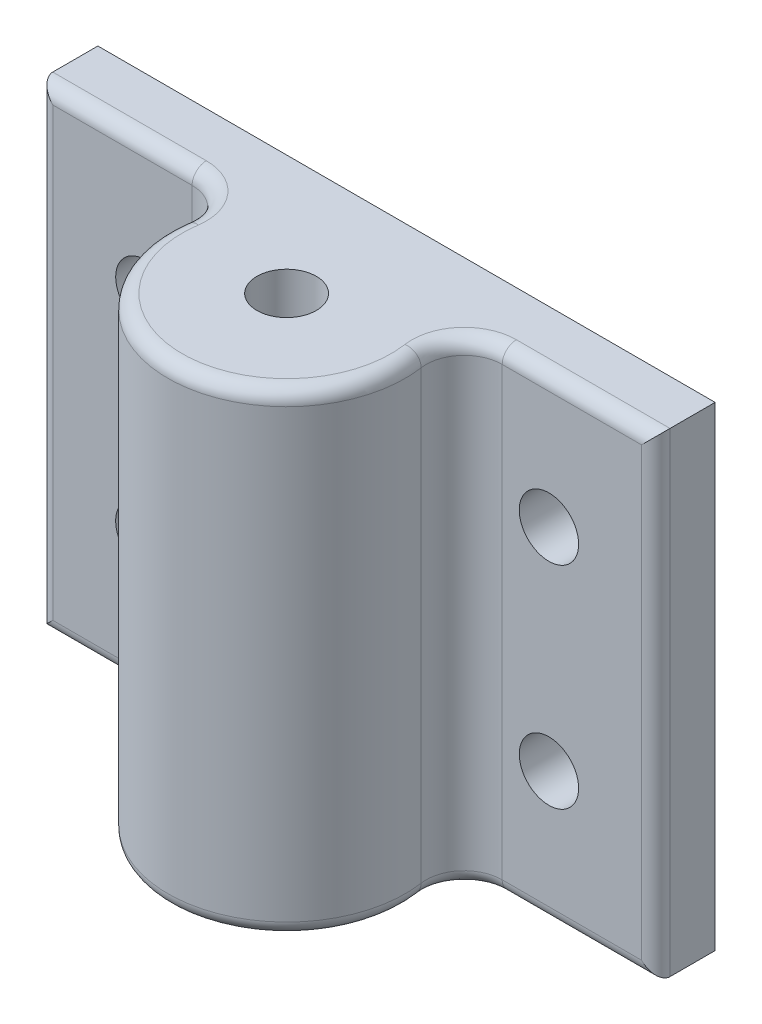
ISO-10303-21;
HEADER;
FILE_DESCRIPTION(('STEP AP214'),'2;1');
FILE_NAME('part.step','',(''),(''),'','','');
FILE_SCHEMA(('AUTOMOTIVE_DESIGN { 1 0 10303 214 1 1 1 1 }'));
ENDSEC;
DATA;
#1=APPLICATION_CONTEXT('core data for automotive mechanical design processes');
#2=APPLICATION_PROTOCOL_DEFINITION('international standard','automotive_design',2000,#1);
#3=PRODUCT_CONTEXT('',#1,'mechanical');
#4=PRODUCT('Part','Part','',(#3));
#5=PRODUCT_RELATED_PRODUCT_CATEGORY('part','',(#4));
#6=PRODUCT_DEFINITION_FORMATION('','',#4);
#7=PRODUCT_DEFINITION_CONTEXT('part definition',#1,'design');
#8=PRODUCT_DEFINITION('design','',#6,#7);
#9=PRODUCT_DEFINITION_SHAPE('','',#8);
#10=(LENGTH_UNIT() NAMED_UNIT(*) SI_UNIT(.MILLI.,.METRE.));
#11=(NAMED_UNIT(*) PLANE_ANGLE_UNIT() SI_UNIT($,.RADIAN.));
#12=(NAMED_UNIT(*) SI_UNIT($,.STERADIAN.) SOLID_ANGLE_UNIT());
#13=UNCERTAINTY_MEASURE_WITH_UNIT(LENGTH_MEASURE(1.E-05),#10,'distance_accuracy_value','');
#14=(GEOMETRIC_REPRESENTATION_CONTEXT(3) GLOBAL_UNCERTAINTY_ASSIGNED_CONTEXT((#13)) GLOBAL_UNIT_ASSIGNED_CONTEXT((#10,
#11,#12)) REPRESENTATION_CONTEXT('',''));
#15=CARTESIAN_POINT('',(0.,0.,0.));
#16=DIRECTION('',(0.,0.,1.));
#17=DIRECTION('',(1.,0.,0.));
#18=AXIS2_PLACEMENT_3D('',#15,#16,#17);
#19=CARTESIAN_POINT('',(0.,12.7,0.));
#20=DIRECTION('',(0.,-1.,0.));
#21=DIRECTION('',(0.,0.,-1.));
#22=AXIS2_PLACEMENT_3D('',#19,#20,#21);
#23=CYLINDRICAL_SURFACE('',#22,6.35);
#24=DIRECTION('',(0.,-1.,0.));
#25=VECTOR('',#24,1.);
#26=CARTESIAN_POINT('',(-6.28387430673153,12.7,-0.914015151515158));
#27=LINE('',#26,#25);
#28=CARTESIAN_POINT('',(-6.28387430673153,11.938,-0.914015151515158));
#29=VERTEX_POINT('',#28);
#30=CARTESIAN_POINT('',(-6.28387430673153,-11.938,-0.914015151515158));
#31=VERTEX_POINT('',#30);
#32=EDGE_CURVE('E163',#29,#31,#27,.T.);
#33=ORIENTED_EDGE('',*,*,#32,.T.);
#34=CARTESIAN_POINT('',(0.,-11.938,0.));
#35=DIRECTION('',(0.,1.,0.));
#36=DIRECTION('',(0.,0.,1.));
#37=AXIS2_PLACEMENT_3D('',#34,#35,#36);
#38=CIRCLE('',#37,6.35);
#39=CARTESIAN_POINT('',(6.28387430673153,-11.938,-0.914015151515158));
#40=VERTEX_POINT('',#39);
#41=EDGE_CURVE('E217',#31,#40,#38,.T.);
#42=ORIENTED_EDGE('',*,*,#41,.T.);
#43=DIRECTION('',(0.,-1.,0.));
#44=VECTOR('',#43,1.);
#45=CARTESIAN_POINT('',(6.28387430673153,12.7,-0.914015151515158));
#46=LINE('',#45,#44);
#47=CARTESIAN_POINT('',(6.28387430673153,11.938,-0.914015151515158));
#48=VERTEX_POINT('',#47);
#49=EDGE_CURVE('E160',#40,#48,#46,.F.);
#50=ORIENTED_EDGE('',*,*,#49,.T.);
#51=CARTESIAN_POINT('',(0.,11.938,0.));
#52=DIRECTION('',(0.,1.,0.));
#53=DIRECTION('',(0.,0.,1.));
#54=AXIS2_PLACEMENT_3D('',#51,#52,#53);
#55=CIRCLE('',#54,6.35);
#56=EDGE_CURVE('E215',#48,#29,#55,.F.);
#57=ORIENTED_EDGE('',*,*,#56,.T.);
#58=EDGE_LOOP('',(#33,#42,#50,#57));
#59=FACE_BOUND('',#58,.T.);
#60=ADVANCED_FACE('F34',(#59),#23,.T.);
#61=CARTESIAN_POINT('',(0.,12.7,0.));
#62=DIRECTION('',(0.,1.,0.));
#63=DIRECTION('',(0.,0.,1.));
#64=AXIS2_PLACEMENT_3D('',#61,#62,#63);
#65=PLANE('',#64);
#66=DIRECTION('',(0.,0.,-1.));
#67=VECTOR('',#66,1.);
#68=CARTESIAN_POINT('',(-16.51,12.7,-3.23850000000001));
#69=LINE('',#68,#67);
#70=CARTESIAN_POINT('',(-16.51,12.7,-4.00050000000001));
#71=VERTEX_POINT('',#70);
#72=CARTESIAN_POINT('',(-16.51,12.7,-6.41350000000001));
#73=VERTEX_POINT('',#72);
#74=EDGE_CURVE('E154',#71,#73,#69,.T.);
#75=ORIENTED_EDGE('',*,*,#74,.F.);
#76=DIRECTION('',(-1.,0.,0.));
#77=VECTOR('',#76,1.);
#78=CARTESIAN_POINT('',(0.,12.7,-4.00050000000001));
#79=LINE('',#78,#77);
#80=CARTESIAN_POINT('',(-8.29471408488563,12.7,-4.00050000000001));
#81=VERTEX_POINT('',#80);
#82=EDGE_CURVE('E51',#71,#81,#79,.F.);
#83=ORIENTED_EDGE('',*,*,#82,.T.);
#84=CARTESIAN_POINT('',(-8.29471408488563,12.7,-1.20650000000001));
#85=DIRECTION('',(0.,1.,0.));
#86=DIRECTION('',(0.,0.,1.));
#87=AXIS2_PLACEMENT_3D('',#84,#85,#86);
#88=CIRCLE('',#87,2.794);
#89=CARTESIAN_POINT('',(-5.52980938992375,12.7,-0.804333333333339));
#90=VERTEX_POINT('',#89);
#91=EDGE_CURVE('E212',#81,#90,#88,.F.);
#92=ORIENTED_EDGE('',*,*,#91,.T.);
#93=CARTESIAN_POINT('',(0.,12.7,0.));
#94=DIRECTION('',(0.,1.,0.));
#95=DIRECTION('',(0.,0.,1.));
#96=AXIS2_PLACEMENT_3D('',#93,#94,#95);
#97=CIRCLE('',#96,5.588);
#98=CARTESIAN_POINT('',(5.52980938992375,12.7,-0.804333333333339));
#99=VERTEX_POINT('',#98);
#100=EDGE_CURVE('E208',#90,#99,#97,.T.);
#101=ORIENTED_EDGE('',*,*,#100,.T.);
#102=CARTESIAN_POINT('',(8.29471408488563,12.7,-1.20650000000001));
#103=DIRECTION('',(0.,1.,0.));
#104=DIRECTION('',(0.,0.,1.));
#105=AXIS2_PLACEMENT_3D('',#102,#103,#104);
#106=CIRCLE('',#105,2.794);
#107=CARTESIAN_POINT('',(8.29471408488563,12.7,-4.00050000000001));
#108=VERTEX_POINT('',#107);
#109=EDGE_CURVE('E58',#99,#108,#106,.F.);
#110=ORIENTED_EDGE('',*,*,#109,.T.);
#111=DIRECTION('',(-1.,0.,0.));
#112=VECTOR('',#111,1.);
#113=CARTESIAN_POINT('',(0.,12.7,-4.00050000000001));
#114=LINE('',#113,#112);
#115=CARTESIAN_POINT('',(16.51,12.7,-4.00050000000001));
#116=VERTEX_POINT('',#115);
#117=EDGE_CURVE('E141',#108,#116,#114,.F.);
#118=ORIENTED_EDGE('',*,*,#117,.T.);
#119=DIRECTION('',(0.,0.,-1.));
#120=VECTOR('',#119,1.);
#121=CARTESIAN_POINT('',(16.51,12.7,-3.23850000000001));
#122=LINE('',#121,#120);
#123=CARTESIAN_POINT('',(16.51,12.7,-6.41349999999999));
#124=VERTEX_POINT('',#123);
#125=EDGE_CURVE('E135',#116,#124,#122,.T.);
#126=ORIENTED_EDGE('',*,*,#125,.T.);
#127=DIRECTION('',(-1.,0.,0.));
#128=VECTOR('',#127,1.);
#129=CARTESIAN_POINT('',(16.51,12.7,-6.41349999999999));
#130=LINE('',#129,#128);
#131=EDGE_CURVE('E139',#124,#73,#130,.T.);
#132=ORIENTED_EDGE('',*,*,#131,.T.);
#133=EDGE_LOOP('',(#75,#83,#92,#101,#110,#118,#126,#132));
#134=FACE_BOUND('',#133,.T.);
#135=CARTESIAN_POINT('',(0.,12.7,0.));
#136=DIRECTION('',(0.,1.,0.));
#137=DIRECTION('',(0.,0.,1.));
#138=AXIS2_PLACEMENT_3D('',#135,#136,#137);
#139=CIRCLE('',#138,1.5875);
#140=CARTESIAN_POINT('',(0.,12.7,1.5875));
#141=VERTEX_POINT('',#140);
#142=EDGE_CURVE('E253',#141,#141,#139,.T.);
#143=ORIENTED_EDGE('',*,*,#142,.F.);
#144=EDGE_LOOP('',(#143));
#145=FACE_BOUND('',#144,.T.);
#146=ADVANCED_FACE('F137',(#134,#145),#65,.T.);
#147=CARTESIAN_POINT('',(0.,-12.7,0.));
#148=DIRECTION('',(0.,1.,0.));
#149=DIRECTION('',(0.,0.,1.));
#150=AXIS2_PLACEMENT_3D('',#147,#148,#149);
#151=PLANE('',#150);
#152=CARTESIAN_POINT('',(-8.29471408488563,-12.7,-1.20650000000001));
#153=DIRECTION('',(0.,1.,0.));
#154=DIRECTION('',(0.,0.,1.));
#155=AXIS2_PLACEMENT_3D('',#152,#153,#154);
#156=CIRCLE('',#155,2.794);
#157=CARTESIAN_POINT('',(-5.52980938992375,-12.7,-0.804333333333339));
#158=VERTEX_POINT('',#157);
#159=CARTESIAN_POINT('',(-8.29471408488563,-12.7,-4.00050000000001));
#160=VERTEX_POINT('',#159);
#161=EDGE_CURVE('E182',#158,#160,#156,.T.);
#162=ORIENTED_EDGE('',*,*,#161,.T.);
#163=DIRECTION('',(-1.,0.,0.));
#164=VECTOR('',#163,1.);
#165=CARTESIAN_POINT('',(-16.51,-12.7,-4.00050000000001));
#166=LINE('',#165,#164);
#167=CARTESIAN_POINT('',(-16.51,-12.7,-4.00050000000001));
#168=VERTEX_POINT('',#167);
#169=EDGE_CURVE('E184',#160,#168,#166,.T.);
#170=ORIENTED_EDGE('',*,*,#169,.T.);
#171=DIRECTION('',(0.,0.,-1.));
#172=VECTOR('',#171,1.);
#173=CARTESIAN_POINT('',(-16.51,-12.7,-3.23850000000001));
#174=LINE('',#173,#172);
#175=CARTESIAN_POINT('',(-16.51,-12.7,-6.41350000000001));
#176=VERTEX_POINT('',#175);
#177=EDGE_CURVE('E145',#168,#176,#174,.T.);
#178=ORIENTED_EDGE('',*,*,#177,.T.);
#179=DIRECTION('',(-1.,0.,0.));
#180=VECTOR('',#179,1.);
#181=CARTESIAN_POINT('',(16.51,-12.7,-6.41349999999999));
#182=LINE('',#181,#180);
#183=CARTESIAN_POINT('',(16.51,-12.7,-6.41349999999999));
#184=VERTEX_POINT('',#183);
#185=EDGE_CURVE('E291',#184,#176,#182,.T.);
#186=ORIENTED_EDGE('',*,*,#185,.F.);
#187=DIRECTION('',(0.,0.,-1.));
#188=VECTOR('',#187,1.);
#189=CARTESIAN_POINT('',(16.51,-12.7,-3.23850000000001));
#190=LINE('',#189,#188);
#191=CARTESIAN_POINT('',(16.51,-12.7,-4.00050000000001));
#192=VERTEX_POINT('',#191);
#193=EDGE_CURVE('E158',#192,#184,#190,.T.);
#194=ORIENTED_EDGE('',*,*,#193,.F.);
#195=DIRECTION('',(-1.,0.,0.));
#196=VECTOR('',#195,1.);
#197=CARTESIAN_POINT('',(8.29471408488563,-12.7,-4.00050000000001));
#198=LINE('',#197,#196);
#199=CARTESIAN_POINT('',(8.29471408488563,-12.7,-4.00050000000001));
#200=VERTEX_POINT('',#199);
#201=EDGE_CURVE('E180',#192,#200,#198,.T.);
#202=ORIENTED_EDGE('',*,*,#201,.T.);
#203=CARTESIAN_POINT('',(8.29471408488563,-12.7,-1.20650000000001));
#204=DIRECTION('',(0.,1.,0.));
#205=DIRECTION('',(0.,0.,1.));
#206=AXIS2_PLACEMENT_3D('',#203,#204,#205);
#207=CIRCLE('',#206,2.794);
#208=CARTESIAN_POINT('',(5.52980938992375,-12.7,-0.804333333333339));
#209=VERTEX_POINT('',#208);
#210=EDGE_CURVE('E178',#200,#209,#207,.T.);
#211=ORIENTED_EDGE('',*,*,#210,.T.);
#212=CARTESIAN_POINT('',(0.,-12.7,0.));
#213=DIRECTION('',(0.,1.,0.));
#214=DIRECTION('',(0.,0.,1.));
#215=AXIS2_PLACEMENT_3D('',#212,#213,#214);
#216=CIRCLE('',#215,5.588);
#217=EDGE_CURVE('E176',#209,#158,#216,.F.);
#218=ORIENTED_EDGE('',*,*,#217,.T.);
#219=EDGE_LOOP('',(#162,#170,#178,#186,#194,#202,#211,#218));
#220=FACE_BOUND('',#219,.T.);
#221=ADVANCED_FACE('F294',(#220),#151,.F.);
#222=CARTESIAN_POINT('',(16.51,12.7,-3.23850000000001));
#223=DIRECTION('',(0.,0.,1.));
#224=DIRECTION('',(1.,0.,0.));
#225=AXIS2_PLACEMENT_3D('',#222,#223,#224);
#226=PLANE('',#225);
#227=CARTESIAN_POINT('',(-10.795,5.6515,-3.23850000000001));
#228=DIRECTION('',(0.,0.,1.));
#229=DIRECTION('',(-1.,0.,0.));
#230=AXIS2_PLACEMENT_3D('',#227,#228,#229);
#231=CIRCLE('',#230,1.5875);
#232=CARTESIAN_POINT('',(-12.3825,5.6515,-3.23850000000001));
#233=VERTEX_POINT('',#232);
#234=EDGE_CURVE('E263',#233,#233,#231,.T.);
#235=ORIENTED_EDGE('',*,*,#234,.F.);
#236=EDGE_LOOP('',(#235));
#237=FACE_BOUND('',#236,.T.);
#238=CARTESIAN_POINT('',(-10.795,-5.6515,-3.23850000000001));
#239=DIRECTION('',(0.,0.,1.));
#240=DIRECTION('',(1.,0.,0.));
#241=AXIS2_PLACEMENT_3D('',#238,#239,#240);
#242=CIRCLE('',#241,1.5875);
#243=CARTESIAN_POINT('',(-9.2075,-5.6515,-3.23850000000001));
#244=VERTEX_POINT('',#243);
#245=EDGE_CURVE('E271',#244,#244,#242,.T.);
#246=ORIENTED_EDGE('',*,*,#245,.F.);
#247=EDGE_LOOP('',(#246));
#248=FACE_BOUND('',#247,.T.);
#249=DIRECTION('',(0.,-1.,0.));
#250=VECTOR('',#249,1.);
#251=CARTESIAN_POINT('',(-15.748,12.7,-3.23850000000001));
#252=LINE('',#251,#250);
#253=CARTESIAN_POINT('',(-15.748,11.938,-3.23850000000001));
#254=VERTEX_POINT('',#253);
#255=CARTESIAN_POINT('',(-15.748,-11.938,-3.23850000000001));
#256=VERTEX_POINT('',#255);
#257=EDGE_CURVE('E187',#254,#256,#252,.T.);
#258=ORIENTED_EDGE('',*,*,#257,.T.);
#259=DIRECTION('',(-1.,0.,0.));
#260=VECTOR('',#259,1.);
#261=CARTESIAN_POINT('',(-8.29471408488563,-11.938,-3.23850000000001));
#262=LINE('',#261,#260);
#263=CARTESIAN_POINT('',(-8.29471408488563,-11.938,-3.23850000000001));
#264=VERTEX_POINT('',#263);
#265=EDGE_CURVE('E191',#256,#264,#262,.F.);
#266=ORIENTED_EDGE('',*,*,#265,.T.);
#267=DIRECTION('',(0.,-1.,0.));
#268=VECTOR('',#267,1.);
#269=CARTESIAN_POINT('',(-8.29471408488563,12.7,-3.23850000000001));
#270=LINE('',#269,#268);
#271=CARTESIAN_POINT('',(-8.29471408488563,11.938,-3.23850000000001));
#272=VERTEX_POINT('',#271);
#273=EDGE_CURVE('E170',#264,#272,#270,.F.);
#274=ORIENTED_EDGE('',*,*,#273,.T.);
#275=DIRECTION('',(-1.,0.,0.));
#276=VECTOR('',#275,1.);
#277=CARTESIAN_POINT('',(16.51,11.938,-3.23850000000001));
#278=LINE('',#277,#276);
#279=EDGE_CURVE('E189',#272,#254,#278,.T.);
#280=ORIENTED_EDGE('',*,*,#279,.T.);
#281=EDGE_LOOP('',(#258,#266,#274,#280));
#282=FACE_BOUND('',#281,.T.);
#283=ADVANCED_FACE('F310',(#237,#248,#282),#226,.T.);
#284=DIRECTION('',(0.,-1.,0.));
#285=VECTOR('',#284,1.);
#286=CARTESIAN_POINT('',(8.29471408488563,12.7,-3.23850000000001));
#287=LINE('',#286,#285);
#288=CARTESIAN_POINT('',(8.29471408488563,11.938,-3.23850000000001));
#289=VERTEX_POINT('',#288);
#290=CARTESIAN_POINT('',(8.29471408488563,-11.938,-3.23850000000001));
#291=VERTEX_POINT('',#290);
#292=EDGE_CURVE('E173',#289,#291,#287,.T.);
#293=ORIENTED_EDGE('',*,*,#292,.T.);
#294=DIRECTION('',(-1.,0.,0.));
#295=VECTOR('',#294,1.);
#296=CARTESIAN_POINT('',(16.51,-11.938,-3.23850000000001));
#297=LINE('',#296,#295);
#298=CARTESIAN_POINT('',(15.748,-11.938,-3.23850000000001));
#299=VERTEX_POINT('',#298);
#300=EDGE_CURVE('E202',#291,#299,#297,.F.);
#301=ORIENTED_EDGE('',*,*,#300,.T.);
#302=DIRECTION('',(0.,-1.,0.));
#303=VECTOR('',#302,1.);
#304=CARTESIAN_POINT('',(15.748,12.7,-3.23850000000001));
#305=LINE('',#304,#303);
#306=CARTESIAN_POINT('',(15.748,11.938,-3.23850000000001));
#307=VERTEX_POINT('',#306);
#308=EDGE_CURVE('E198',#299,#307,#305,.F.);
#309=ORIENTED_EDGE('',*,*,#308,.T.);
#310=DIRECTION('',(-1.,0.,0.));
#311=VECTOR('',#310,1.);
#312=CARTESIAN_POINT('',(16.51,11.938,-3.23850000000001));
#313=LINE('',#312,#311);
#314=EDGE_CURVE('E200',#307,#289,#313,.T.);
#315=ORIENTED_EDGE('',*,*,#314,.T.);
#316=EDGE_LOOP('',(#293,#301,#309,#315));
#317=FACE_BOUND('',#316,.T.);
#318=CARTESIAN_POINT('',(10.795,-5.6515,-3.23850000000001));
#319=DIRECTION('',(0.,0.,1.));
#320=DIRECTION('',(-1.,0.,0.));
#321=AXIS2_PLACEMENT_3D('',#318,#319,#320);
#322=CIRCLE('',#321,1.5875);
#323=CARTESIAN_POINT('',(9.2075,-5.6515,-3.23850000000001));
#324=VERTEX_POINT('',#323);
#325=EDGE_CURVE('E277',#324,#324,#322,.T.);
#326=ORIENTED_EDGE('',*,*,#325,.F.);
#327=EDGE_LOOP('',(#326));
#328=FACE_BOUND('',#327,.T.);
#329=CARTESIAN_POINT('',(10.795,5.6515,-3.23850000000001));
#330=DIRECTION('',(0.,0.,1.));
#331=DIRECTION('',(1.,0.,0.));
#332=AXIS2_PLACEMENT_3D('',#329,#330,#331);
#333=CIRCLE('',#332,1.5875);
#334=CARTESIAN_POINT('',(12.3825,5.6515,-3.23850000000001));
#335=VERTEX_POINT('',#334);
#336=EDGE_CURVE('E283',#335,#335,#333,.T.);
#337=ORIENTED_EDGE('',*,*,#336,.F.);
#338=EDGE_LOOP('',(#337));
#339=FACE_BOUND('',#338,.T.);
#340=ADVANCED_FACE('F342',(#317,#328,#339),#226,.T.);
#341=CARTESIAN_POINT('',(16.51,12.7,-3.23850000000001));
#342=DIRECTION('',(-1.,0.,0.));
#343=DIRECTION('',(0.,0.,1.));
#344=AXIS2_PLACEMENT_3D('',#341,#342,#343);
#345=PLANE('',#344);
#346=ORIENTED_EDGE('',*,*,#125,.F.);
#347=DIRECTION('',(0.,-1.,0.));
#348=VECTOR('',#347,1.);
#349=CARTESIAN_POINT('',(16.51,-12.7,-4.00050000000001));
#350=LINE('',#349,#348);
#351=EDGE_CURVE('E43',#116,#192,#350,.T.);
#352=ORIENTED_EDGE('',*,*,#351,.T.);
#353=ORIENTED_EDGE('',*,*,#193,.T.);
#354=DIRECTION('',(0.,-1.,0.));
#355=VECTOR('',#354,1.);
#356=CARTESIAN_POINT('',(16.51,12.7,-6.41349999999999));
#357=LINE('',#356,#355);
#358=EDGE_CURVE('E151',#124,#184,#357,.T.);
#359=ORIENTED_EDGE('',*,*,#358,.F.);
#360=EDGE_LOOP('',(#346,#352,#353,#359));
#361=FACE_BOUND('',#360,.T.);
#362=ADVANCED_FACE('F156',(#361),#345,.F.);
#363=CARTESIAN_POINT('',(16.51,12.7,-6.41349999999999));
#364=DIRECTION('',(0.,0.,1.));
#365=DIRECTION('',(1.,0.,0.));
#366=AXIS2_PLACEMENT_3D('',#363,#364,#365);
#367=PLANE('',#366);
#368=CARTESIAN_POINT('',(-10.795,5.6515,-6.41350000000001));
#369=DIRECTION('',(0.,0.,1.));
#370=DIRECTION('',(1.,0.,0.));
#371=AXIS2_PLACEMENT_3D('',#368,#369,#370);
#372=CIRCLE('',#371,1.5875);
#373=CARTESIAN_POINT('',(-9.2075,5.6515,-6.41350000000001));
#374=VERTEX_POINT('',#373);
#375=EDGE_CURVE('E268',#374,#374,#372,.F.);
#376=ORIENTED_EDGE('',*,*,#375,.F.);
#377=EDGE_LOOP('',(#376));
#378=FACE_BOUND('',#377,.T.);
#379=CARTESIAN_POINT('',(-10.795,-5.6515,-6.41350000000001));
#380=DIRECTION('',(0.,0.,1.));
#381=DIRECTION('',(1.,0.,0.));
#382=AXIS2_PLACEMENT_3D('',#379,#380,#381);
#383=CIRCLE('',#382,1.5875);
#384=CARTESIAN_POINT('',(-9.2075,-5.6515,-6.41350000000001));
#385=VERTEX_POINT('',#384);
#386=EDGE_CURVE('E274',#385,#385,#383,.F.);
#387=ORIENTED_EDGE('',*,*,#386,.F.);
#388=EDGE_LOOP('',(#387));
#389=FACE_BOUND('',#388,.T.);
#390=CARTESIAN_POINT('',(10.795,-5.6515,-6.4135));
#391=DIRECTION('',(0.,0.,1.));
#392=DIRECTION('',(1.,0.,0.));
#393=AXIS2_PLACEMENT_3D('',#390,#391,#392);
#394=CIRCLE('',#393,1.5875);
#395=CARTESIAN_POINT('',(12.3825,-5.6515,-6.4135));
#396=VERTEX_POINT('',#395);
#397=EDGE_CURVE('E280',#396,#396,#394,.F.);
#398=ORIENTED_EDGE('',*,*,#397,.F.);
#399=EDGE_LOOP('',(#398));
#400=FACE_BOUND('',#399,.T.);
#401=CARTESIAN_POINT('',(10.795,5.6515,-6.4135));
#402=DIRECTION('',(0.,0.,1.));
#403=DIRECTION('',(1.,0.,0.));
#404=AXIS2_PLACEMENT_3D('',#401,#402,#403);
#405=CIRCLE('',#404,1.5875);
#406=CARTESIAN_POINT('',(12.3825,5.6515,-6.4135));
#407=VERTEX_POINT('',#406);
#408=EDGE_CURVE('E286',#407,#407,#405,.F.);
#409=ORIENTED_EDGE('',*,*,#408,.F.);
#410=EDGE_LOOP('',(#409));
#411=FACE_BOUND('',#410,.T.);
#412=ORIENTED_EDGE('',*,*,#185,.T.);
#413=DIRECTION('',(0.,-1.,0.));
#414=VECTOR('',#413,1.);
#415=CARTESIAN_POINT('',(-16.51,12.7,-6.41350000000001));
#416=LINE('',#415,#414);
#417=EDGE_CURVE('E153',#73,#176,#416,.T.);
#418=ORIENTED_EDGE('',*,*,#417,.F.);
#419=ORIENTED_EDGE('',*,*,#131,.F.);
#420=ORIENTED_EDGE('',*,*,#358,.T.);
#421=EDGE_LOOP('',(#412,#418,#419,#420));
#422=FACE_BOUND('',#421,.T.);
#423=ADVANCED_FACE('F150',(#378,#389,#400,#411,#422),#367,.F.);
#424=CARTESIAN_POINT('',(-16.51,12.7,-3.23850000000001));
#425=DIRECTION('',(-1.,0.,0.));
#426=DIRECTION('',(0.,0.,1.));
#427=AXIS2_PLACEMENT_3D('',#424,#425,#426);
#428=PLANE('',#427);
#429=ORIENTED_EDGE('',*,*,#177,.F.);
#430=DIRECTION('',(0.,-1.,0.));
#431=VECTOR('',#430,1.);
#432=CARTESIAN_POINT('',(-16.51,12.7,-4.00050000000001));
#433=LINE('',#432,#431);
#434=EDGE_CURVE('E11',#168,#71,#433,.F.);
#435=ORIENTED_EDGE('',*,*,#434,.T.);
#436=ORIENTED_EDGE('',*,*,#74,.T.);
#437=ORIENTED_EDGE('',*,*,#417,.T.);
#438=EDGE_LOOP('',(#429,#435,#436,#437));
#439=FACE_BOUND('',#438,.T.);
#440=ADVANCED_FACE('F297',(#439),#428,.T.);
#441=CARTESIAN_POINT('',(10.795,5.6515,-6.41450000000001));
#442=DIRECTION('',(0.,0.,1.));
#443=DIRECTION('',(1.,0.,0.));
#444=AXIS2_PLACEMENT_3D('',#441,#442,#443);
#445=CYLINDRICAL_SURFACE('',#444,1.5875);
#446=ORIENTED_EDGE('',*,*,#336,.T.);
#447=EDGE_LOOP('',(#446));
#448=FACE_BOUND('',#447,.T.);
#449=ORIENTED_EDGE('',*,*,#408,.T.);
#450=EDGE_LOOP('',(#449));
#451=FACE_BOUND('',#450,.T.);
#452=ADVANCED_FACE('F520',(#448,#451),#445,.F.);
#453=CARTESIAN_POINT('',(10.795,-5.6515,-6.41450000000001));
#454=DIRECTION('',(0.,0.,1.));
#455=DIRECTION('',(1.,0.,0.));
#456=AXIS2_PLACEMENT_3D('',#453,#454,#455);
#457=CYLINDRICAL_SURFACE('',#456,1.5875);
#458=ORIENTED_EDGE('',*,*,#325,.T.);
#459=EDGE_LOOP('',(#458));
#460=FACE_BOUND('',#459,.T.);
#461=ORIENTED_EDGE('',*,*,#397,.T.);
#462=EDGE_LOOP('',(#461));
#463=FACE_BOUND('',#462,.T.);
#464=ADVANCED_FACE('F511',(#460,#463),#457,.F.);
#465=CARTESIAN_POINT('',(-10.795,-5.6515,-6.41450000000001));
#466=DIRECTION('',(0.,0.,1.));
#467=DIRECTION('',(1.,0.,0.));
#468=AXIS2_PLACEMENT_3D('',#465,#466,#467);
#469=CYLINDRICAL_SURFACE('',#468,1.5875);
#470=ORIENTED_EDGE('',*,*,#245,.T.);
#471=EDGE_LOOP('',(#470));
#472=FACE_BOUND('',#471,.T.);
#473=ORIENTED_EDGE('',*,*,#386,.T.);
#474=EDGE_LOOP('',(#473));
#475=FACE_BOUND('',#474,.T.);
#476=ADVANCED_FACE('F502',(#472,#475),#469,.F.);
#477=CARTESIAN_POINT('',(-10.795,5.6515,-6.41450000000001));
#478=DIRECTION('',(0.,0.,1.));
#479=DIRECTION('',(1.,0.,0.));
#480=AXIS2_PLACEMENT_3D('',#477,#478,#479);
#481=CYLINDRICAL_SURFACE('',#480,1.5875);
#482=ORIENTED_EDGE('',*,*,#234,.T.);
#483=EDGE_LOOP('',(#482));
#484=FACE_BOUND('',#483,.T.);
#485=ORIENTED_EDGE('',*,*,#375,.T.);
#486=EDGE_LOOP('',(#485));
#487=FACE_BOUND('',#486,.T.);
#488=ADVANCED_FACE('F493',(#484,#487),#481,.F.);
#489=CARTESIAN_POINT('',(0.,-6.35,0.));
#490=DIRECTION('',(0.,1.,0.));
#491=DIRECTION('',(0.,0.,1.));
#492=AXIS2_PLACEMENT_3D('',#489,#490,#491);
#493=CYLINDRICAL_SURFACE('',#492,1.5875);
#494=CARTESIAN_POINT('',(0.,-6.35,0.));
#495=DIRECTION('',(0.,1.,0.));
#496=DIRECTION('',(0.,0.,1.));
#497=AXIS2_PLACEMENT_3D('',#494,#495,#496);
#498=CIRCLE('',#497,1.5875);
#499=CARTESIAN_POINT('',(0.,-6.35,1.5875));
#500=VERTEX_POINT('',#499);
#501=EDGE_CURVE('E258',#500,#500,#498,.T.);
#502=ORIENTED_EDGE('',*,*,#501,.F.);
#503=EDGE_LOOP('',(#502));
#504=FACE_BOUND('',#503,.T.);
#505=ORIENTED_EDGE('',*,*,#142,.T.);
#506=EDGE_LOOP('',(#505));
#507=FACE_BOUND('',#506,.T.);
#508=ADVANCED_FACE('F484',(#504,#507),#493,.F.);
#509=CARTESIAN_POINT('',(0.,-6.35,0.));
#510=DIRECTION('',(0.,1.,0.));
#511=DIRECTION('',(0.,0.,1.));
#512=AXIS2_PLACEMENT_3D('',#509,#510,#511);
#513=PLANE('',#512);
#514=ORIENTED_EDGE('',*,*,#501,.T.);
#515=EDGE_LOOP('',(#514));
#516=FACE_BOUND('',#515,.T.);
#517=ADVANCED_FACE('F377',(#516),#513,.T.);
#518=CARTESIAN_POINT('',(-8.29471408488563,12.7,-1.20650000000001));
#519=DIRECTION('',(0.,-1.,0.));
#520=DIRECTION('',(0.,0.,-1.));
#521=AXIS2_PLACEMENT_3D('',#518,#519,#520);
#522=CYLINDRICAL_SURFACE('',#521,2.032);
#523=ORIENTED_EDGE('',*,*,#273,.F.);
#524=CARTESIAN_POINT('',(-8.29471408488563,-11.938,-1.20650000000001));
#525=DIRECTION('',(0.,1.,0.));
#526=DIRECTION('',(0.,0.,1.));
#527=AXIS2_PLACEMENT_3D('',#524,#525,#526);
#528=CIRCLE('',#527,2.032);
#529=EDGE_CURVE('E196',#264,#31,#528,.F.);
#530=ORIENTED_EDGE('',*,*,#529,.T.);
#531=ORIENTED_EDGE('',*,*,#32,.F.);
#532=CARTESIAN_POINT('',(-8.29471408488563,11.938,-1.20650000000001));
#533=DIRECTION('',(0.,1.,0.));
#534=DIRECTION('',(0.,0.,1.));
#535=AXIS2_PLACEMENT_3D('',#532,#533,#534);
#536=CIRCLE('',#535,2.032);
#537=EDGE_CURVE('E194',#29,#272,#536,.T.);
#538=ORIENTED_EDGE('',*,*,#537,.T.);
#539=EDGE_LOOP('',(#523,#530,#531,#538));
#540=FACE_BOUND('',#539,.T.);
#541=ADVANCED_FACE('F322',(#540),#522,.F.);
#542=CARTESIAN_POINT('',(8.29471408488563,12.7,-1.20650000000001));
#543=DIRECTION('',(0.,-1.,0.));
#544=DIRECTION('',(0.,0.,-1.));
#545=AXIS2_PLACEMENT_3D('',#542,#543,#544);
#546=CYLINDRICAL_SURFACE('',#545,2.032);
#547=ORIENTED_EDGE('',*,*,#49,.F.);
#548=CARTESIAN_POINT('',(8.29471408488563,-11.938,-1.20650000000001));
#549=DIRECTION('',(0.,1.,0.));
#550=DIRECTION('',(0.,0.,1.));
#551=AXIS2_PLACEMENT_3D('',#548,#549,#550);
#552=CIRCLE('',#551,2.032);
#553=EDGE_CURVE('E206',#40,#291,#552,.F.);
#554=ORIENTED_EDGE('',*,*,#553,.T.);
#555=ORIENTED_EDGE('',*,*,#292,.F.);
#556=CARTESIAN_POINT('',(8.29471408488563,11.938,-1.20650000000001));
#557=DIRECTION('',(0.,1.,0.));
#558=DIRECTION('',(0.,0.,1.));
#559=AXIS2_PLACEMENT_3D('',#556,#557,#558);
#560=CIRCLE('',#559,2.032);
#561=EDGE_CURVE('E204',#289,#48,#560,.T.);
#562=ORIENTED_EDGE('',*,*,#561,.T.);
#563=EDGE_LOOP('',(#547,#554,#555,#562));
#564=FACE_BOUND('',#563,.T.);
#565=ADVANCED_FACE('F339',(#564),#546,.F.);
#566=CARTESIAN_POINT('',(16.51,11.938,-4.00050000000001));
#567=DIRECTION('',(-1.,0.,0.));
#568=DIRECTION('',(0.,0.,1.));
#569=AXIS2_PLACEMENT_3D('',#566,#567,#568);
#570=CYLINDRICAL_SURFACE('',#569,0.762);
#571=CARTESIAN_POINT('',(8.29471408488563,11.938,-4.00050000000001));
#572=DIRECTION('',(-1.,0.,0.));
#573=DIRECTION('',(0.,0.,1.));
#574=AXIS2_PLACEMENT_3D('',#571,#572,#573);
#575=CIRCLE('',#574,0.762);
#576=EDGE_CURVE('E247',#289,#108,#575,.T.);
#577=ORIENTED_EDGE('',*,*,#576,.F.);
#578=ORIENTED_EDGE('',*,*,#314,.F.);
#579=CARTESIAN_POINT('',(15.748,11.938,-4.00050000000001));
#580=DIRECTION('',(-0.707106781186547,0.707106781186547,0.));
#581=DIRECTION('',(0.707106781186547,0.707106781186547,0.));
#582=AXIS2_PLACEMENT_3D('',#579,#580,#581);
#583=ELLIPSE('',#582,1.0776307345283,0.762);
#584=EDGE_CURVE('E38',#116,#307,#583,.F.);
#585=ORIENTED_EDGE('',*,*,#584,.F.);
#586=ORIENTED_EDGE('',*,*,#117,.F.);
#587=EDGE_LOOP('',(#577,#578,#585,#586));
#588=FACE_BOUND('',#587,.T.);
#589=ADVANCED_FACE('F36',(#588),#570,.T.);
#590=CARTESIAN_POINT('',(15.748,12.7,-4.00050000000001));
#591=DIRECTION('',(0.,1.,0.));
#592=DIRECTION('',(0.,0.,1.));
#593=AXIS2_PLACEMENT_3D('',#590,#591,#592);
#594=CYLINDRICAL_SURFACE('',#593,0.762);
#595=ORIENTED_EDGE('',*,*,#584,.T.);
#596=ORIENTED_EDGE('',*,*,#308,.F.);
#597=CARTESIAN_POINT('',(15.748,-11.938,-4.00050000000001));
#598=DIRECTION('',(0.707106781186547,0.707106781186547,0.));
#599=DIRECTION('',(-0.707106781186547,0.707106781186547,0.));
#600=AXIS2_PLACEMENT_3D('',#597,#598,#599);
#601=ELLIPSE('',#600,1.0776307345283,0.762);
#602=EDGE_CURVE('E245',#192,#299,#601,.F.);
#603=ORIENTED_EDGE('',*,*,#602,.F.);
#604=ORIENTED_EDGE('',*,*,#351,.F.);
#605=EDGE_LOOP('',(#595,#596,#603,#604));
#606=FACE_BOUND('',#605,.T.);
#607=ADVANCED_FACE('F349',(#606),#594,.T.);
#608=CARTESIAN_POINT('',(8.29471408488563,11.938,-1.20650000000001));
#609=DIRECTION('',(0.,1.,0.));
#610=DIRECTION('',(0.,0.,1.));
#611=AXIS2_PLACEMENT_3D('',#608,#609,#610);
#612=TOROIDAL_SURFACE('',#611,2.794,0.762);
#613=ORIENTED_EDGE('',*,*,#576,.T.);
#614=ORIENTED_EDGE('',*,*,#109,.F.);
#615=CARTESIAN_POINT('',(5.52980938992375,11.938,-0.804333333333339));
#616=DIRECTION('',(0.143939393939395,0.,0.989586504997092));
#617=DIRECTION('',(0.989586504997092,0.,-0.143939393939395));
#618=AXIS2_PLACEMENT_3D('',#615,#616,#617);
#619=CIRCLE('',#618,0.762);
#620=EDGE_CURVE('E242',#48,#99,#619,.T.);
#621=ORIENTED_EDGE('',*,*,#620,.F.);
#622=ORIENTED_EDGE('',*,*,#561,.F.);
#623=EDGE_LOOP('',(#613,#614,#621,#622));
#624=FACE_BOUND('',#623,.T.);
#625=ADVANCED_FACE('F352',(#624),#612,.T.);
#626=CARTESIAN_POINT('',(0.,-11.938,-4.00050000000001));
#627=DIRECTION('',(1.,0.,0.));
#628=DIRECTION('',(0.,0.,-1.));
#629=AXIS2_PLACEMENT_3D('',#626,#627,#628);
#630=CYLINDRICAL_SURFACE('',#629,0.762);
#631=ORIENTED_EDGE('',*,*,#602,.T.);
#632=ORIENTED_EDGE('',*,*,#300,.F.);
#633=CARTESIAN_POINT('',(8.29471408488563,-11.938,-4.00050000000001));
#634=DIRECTION('',(-1.,0.,0.));
#635=DIRECTION('',(0.,0.,1.));
#636=AXIS2_PLACEMENT_3D('',#633,#634,#635);
#637=CIRCLE('',#636,0.762);
#638=EDGE_CURVE('E239',#200,#291,#637,.T.);
#639=ORIENTED_EDGE('',*,*,#638,.F.);
#640=ORIENTED_EDGE('',*,*,#201,.F.);
#641=EDGE_LOOP('',(#631,#632,#639,#640));
#642=FACE_BOUND('',#641,.T.);
#643=ADVANCED_FACE('F346',(#642),#630,.T.);
#644=CARTESIAN_POINT('',(0.,11.938,0.));
#645=DIRECTION('',(0.,1.,0.));
#646=DIRECTION('',(0.,0.,1.));
#647=AXIS2_PLACEMENT_3D('',#644,#645,#646);
#648=TOROIDAL_SURFACE('',#647,5.588,0.762);
#649=ORIENTED_EDGE('',*,*,#620,.T.);
#650=ORIENTED_EDGE('',*,*,#100,.F.);
#651=CARTESIAN_POINT('',(-5.52980938992375,11.938,-0.804333333333339));
#652=DIRECTION('',(0.143939393939395,0.,-0.989586504997092));
#653=DIRECTION('',(-0.989586504997092,0.,-0.143939393939395));
#654=AXIS2_PLACEMENT_3D('',#651,#652,#653);
#655=CIRCLE('',#654,0.762);
#656=EDGE_CURVE('E236',#29,#90,#655,.T.);
#657=ORIENTED_EDGE('',*,*,#656,.F.);
#658=ORIENTED_EDGE('',*,*,#56,.F.);
#659=EDGE_LOOP('',(#649,#650,#657,#658));
#660=FACE_BOUND('',#659,.T.);
#661=ADVANCED_FACE('F355',(#660),#648,.T.);
#662=CARTESIAN_POINT('',(8.29471408488563,-11.938,-1.20650000000001));
#663=DIRECTION('',(0.,1.,0.));
#664=DIRECTION('',(0.,0.,1.));
#665=AXIS2_PLACEMENT_3D('',#662,#663,#664);
#666=TOROIDAL_SURFACE('',#665,2.794,0.762);
#667=ORIENTED_EDGE('',*,*,#638,.T.);
#668=ORIENTED_EDGE('',*,*,#553,.F.);
#669=CARTESIAN_POINT('',(5.52980938992375,-11.938,-0.804333333333339));
#670=DIRECTION('',(0.143939393939395,0.,0.989586504997092));
#671=DIRECTION('',(0.989586504997092,0.,-0.143939393939395));
#672=AXIS2_PLACEMENT_3D('',#669,#670,#671);
#673=CIRCLE('',#672,0.762);
#674=EDGE_CURVE('E233',#209,#40,#673,.T.);
#675=ORIENTED_EDGE('',*,*,#674,.F.);
#676=ORIENTED_EDGE('',*,*,#210,.F.);
#677=EDGE_LOOP('',(#667,#668,#675,#676));
#678=FACE_BOUND('',#677,.T.);
#679=ADVANCED_FACE('F335',(#678),#666,.T.);
#680=CARTESIAN_POINT('',(-8.29471408488563,11.938,-1.20650000000001));
#681=DIRECTION('',(0.,1.,0.));
#682=DIRECTION('',(0.,0.,1.));
#683=AXIS2_PLACEMENT_3D('',#680,#681,#682);
#684=TOROIDAL_SURFACE('',#683,2.794,0.762);
#685=ORIENTED_EDGE('',*,*,#656,.T.);
#686=ORIENTED_EDGE('',*,*,#91,.F.);
#687=CARTESIAN_POINT('',(-8.29471408488563,11.938,-4.00050000000001));
#688=DIRECTION('',(-1.,0.,0.));
#689=DIRECTION('',(0.,0.,1.));
#690=AXIS2_PLACEMENT_3D('',#687,#688,#689);
#691=CIRCLE('',#690,0.762);
#692=EDGE_CURVE('E230',#272,#81,#691,.T.);
#693=ORIENTED_EDGE('',*,*,#692,.F.);
#694=ORIENTED_EDGE('',*,*,#537,.F.);
#695=EDGE_LOOP('',(#685,#686,#693,#694));
#696=FACE_BOUND('',#695,.T.);
#697=ADVANCED_FACE('F358',(#696),#684,.T.);
#698=CARTESIAN_POINT('',(0.,-11.938,0.));
#699=DIRECTION('',(0.,1.,0.));
#700=DIRECTION('',(0.,0.,1.));
#701=AXIS2_PLACEMENT_3D('',#698,#699,#700);
#702=TOROIDAL_SURFACE('',#701,5.588,0.762);
#703=ORIENTED_EDGE('',*,*,#674,.T.);
#704=ORIENTED_EDGE('',*,*,#41,.F.);
#705=CARTESIAN_POINT('',(-5.52980938992375,-11.938,-0.804333333333339));
#706=DIRECTION('',(0.143939393939395,0.,-0.989586504997092));
#707=DIRECTION('',(-0.989586504997092,0.,-0.143939393939395));
#708=AXIS2_PLACEMENT_3D('',#705,#706,#707);
#709=CIRCLE('',#708,0.762);
#710=EDGE_CURVE('E227',#158,#31,#709,.T.);
#711=ORIENTED_EDGE('',*,*,#710,.F.);
#712=ORIENTED_EDGE('',*,*,#217,.F.);
#713=EDGE_LOOP('',(#703,#704,#711,#712));
#714=FACE_BOUND('',#713,.T.);
#715=ADVANCED_FACE('F329',(#714),#702,.T.);
#716=CARTESIAN_POINT('',(16.51,11.938,-4.00050000000001));
#717=DIRECTION('',(-1.,0.,0.));
#718=DIRECTION('',(0.,0.,1.));
#719=AXIS2_PLACEMENT_3D('',#716,#717,#718);
#720=CYLINDRICAL_SURFACE('',#719,0.762);
#721=ORIENTED_EDGE('',*,*,#692,.T.);
#722=ORIENTED_EDGE('',*,*,#82,.F.);
#723=CARTESIAN_POINT('',(-15.748,11.938,-4.00050000000001));
#724=DIRECTION('',(-0.707106781186547,-0.707106781186547,0.));
#725=DIRECTION('',(0.707106781186547,-0.707106781186547,0.));
#726=AXIS2_PLACEMENT_3D('',#723,#724,#725);
#727=ELLIPSE('',#726,1.0776307345283,0.762);
#728=EDGE_CURVE('E224',#254,#71,#727,.T.);
#729=ORIENTED_EDGE('',*,*,#728,.F.);
#730=ORIENTED_EDGE('',*,*,#279,.F.);
#731=EDGE_LOOP('',(#721,#722,#729,#730));
#732=FACE_BOUND('',#731,.T.);
#733=ADVANCED_FACE('F301',(#732),#720,.T.);
#734=CARTESIAN_POINT('',(-8.29471408488563,-11.938,-1.20650000000001));
#735=DIRECTION('',(0.,1.,0.));
#736=DIRECTION('',(0.,0.,1.));
#737=AXIS2_PLACEMENT_3D('',#734,#735,#736);
#738=TOROIDAL_SURFACE('',#737,2.794,0.762);
#739=ORIENTED_EDGE('',*,*,#710,.T.);
#740=ORIENTED_EDGE('',*,*,#529,.F.);
#741=CARTESIAN_POINT('',(-8.29471408488563,-11.938,-4.00050000000001));
#742=DIRECTION('',(-1.,0.,0.));
#743=DIRECTION('',(0.,0.,1.));
#744=AXIS2_PLACEMENT_3D('',#741,#742,#743);
#745=CIRCLE('',#744,0.762);
#746=EDGE_CURVE('E222',#160,#264,#745,.T.);
#747=ORIENTED_EDGE('',*,*,#746,.F.);
#748=ORIENTED_EDGE('',*,*,#161,.F.);
#749=EDGE_LOOP('',(#739,#740,#747,#748));
#750=FACE_BOUND('',#749,.T.);
#751=ADVANCED_FACE('F318',(#750),#738,.T.);
#752=CARTESIAN_POINT('',(-15.748,12.7,-4.00050000000001));
#753=DIRECTION('',(0.,-1.,0.));
#754=DIRECTION('',(0.,0.,-1.));
#755=AXIS2_PLACEMENT_3D('',#752,#753,#754);
#756=CYLINDRICAL_SURFACE('',#755,0.762);
#757=ORIENTED_EDGE('',*,*,#728,.T.);
#758=ORIENTED_EDGE('',*,*,#434,.F.);
#759=CARTESIAN_POINT('',(-15.748,-11.938,-4.00050000000001));
#760=DIRECTION('',(0.707106781186547,-0.707106781186547,0.));
#761=DIRECTION('',(-0.707106781186547,-0.707106781186547,0.));
#762=AXIS2_PLACEMENT_3D('',#759,#760,#761);
#763=ELLIPSE('',#762,1.0776307345283,0.762);
#764=EDGE_CURVE('E220',#256,#168,#763,.T.);
#765=ORIENTED_EDGE('',*,*,#764,.F.);
#766=ORIENTED_EDGE('',*,*,#257,.F.);
#767=EDGE_LOOP('',(#757,#758,#765,#766));
#768=FACE_BOUND('',#767,.T.);
#769=ADVANCED_FACE('F306',(#768),#756,.T.);
#770=CARTESIAN_POINT('',(0.,-11.938,-4.00050000000001));
#771=DIRECTION('',(1.,0.,0.));
#772=DIRECTION('',(0.,0.,-1.));
#773=AXIS2_PLACEMENT_3D('',#770,#771,#772);
#774=CYLINDRICAL_SURFACE('',#773,0.762);
#775=ORIENTED_EDGE('',*,*,#746,.T.);
#776=ORIENTED_EDGE('',*,*,#265,.F.);
#777=ORIENTED_EDGE('',*,*,#764,.T.);
#778=ORIENTED_EDGE('',*,*,#169,.F.);
#779=EDGE_LOOP('',(#775,#776,#777,#778));
#780=FACE_BOUND('',#779,.T.);
#781=ADVANCED_FACE('F313',(#780),#774,.T.);
#782=CLOSED_SHELL('',(#60,#146,#221,#283,#340,#362,#423,#440,#452,#464,#476,#488,#508,#517,#541,
#565,#589,#607,#625,#643,#661,#679,#697,#715,#733,#751,#769,#781));
#783=MANIFOLD_SOLID_BREP('B2',#782);
#784=ADVANCED_BREP_SHAPE_REPRESENTATION('',(#18,#783),#14);
#785=SHAPE_DEFINITION_REPRESENTATION(#9,#784);
ENDSEC;
END-ISO-10303-21;
